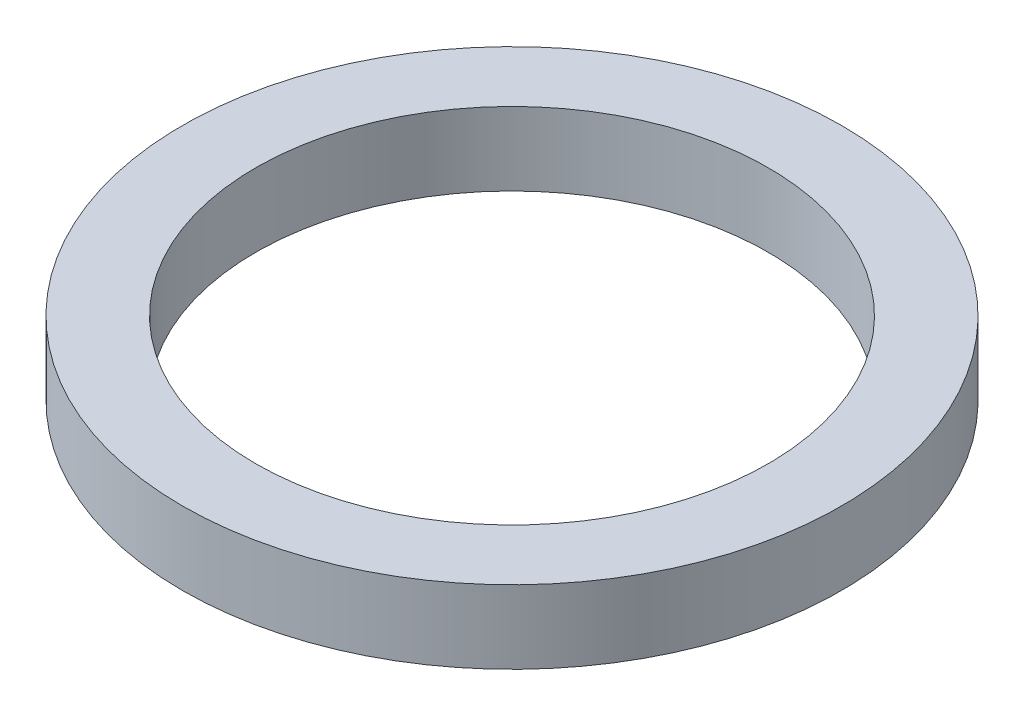
ISO-10303-21;
HEADER;
FILE_DESCRIPTION(('STEP AP214'),'2;1');
FILE_NAME('part.step','',(''),(''),'','','');
FILE_SCHEMA(('AUTOMOTIVE_DESIGN { 1 0 10303 214 1 1 1 1 }'));
ENDSEC;
DATA;
#1=APPLICATION_CONTEXT('core data for automotive mechanical design processes');
#2=APPLICATION_PROTOCOL_DEFINITION('international standard','automotive_design',2000,#1);
#3=PRODUCT_CONTEXT('',#1,'mechanical');
#4=PRODUCT('Part','Part','',(#3));
#5=PRODUCT_RELATED_PRODUCT_CATEGORY('part','',(#4));
#6=PRODUCT_DEFINITION_FORMATION('','',#4);
#7=PRODUCT_DEFINITION_CONTEXT('part definition',#1,'design');
#8=PRODUCT_DEFINITION('design','',#6,#7);
#9=PRODUCT_DEFINITION_SHAPE('','',#8);
#10=(LENGTH_UNIT() NAMED_UNIT(*) SI_UNIT(.MILLI.,.METRE.));
#11=(NAMED_UNIT(*) PLANE_ANGLE_UNIT() SI_UNIT($,.RADIAN.));
#12=(NAMED_UNIT(*) SI_UNIT($,.STERADIAN.) SOLID_ANGLE_UNIT());
#13=UNCERTAINTY_MEASURE_WITH_UNIT(LENGTH_MEASURE(1.E-05),#10,'distance_accuracy_value','');
#14=(GEOMETRIC_REPRESENTATION_CONTEXT(3) GLOBAL_UNCERTAINTY_ASSIGNED_CONTEXT((#13)) GLOBAL_UNIT_ASSIGNED_CONTEXT((#10,
#11,#12)) REPRESENTATION_CONTEXT('',''));
#15=CARTESIAN_POINT('',(0.,0.,0.));
#16=DIRECTION('',(0.,0.,1.));
#17=DIRECTION('',(1.,0.,0.));
#18=AXIS2_PLACEMENT_3D('',#15,#16,#17);
#19=CARTESIAN_POINT('',(0.,10.,0.));
#20=DIRECTION('',(0.,1.,0.));
#21=DIRECTION('',(0.,0.,1.));
#22=AXIS2_PLACEMENT_3D('',#19,#20,#21);
#23=PLANE('',#22);
#24=CARTESIAN_POINT('',(0.,10.,0.));
#25=DIRECTION('',(0.,1.,0.));
#26=DIRECTION('',(0.,0.,1.));
#27=AXIS2_PLACEMENT_3D('',#24,#25,#26);
#28=CIRCLE('',#27,45.);
#29=CARTESIAN_POINT('',(0.,10.,45.));
#30=VERTEX_POINT('',#29);
#31=EDGE_CURVE('E10',#30,#30,#28,.T.);
#32=ORIENTED_EDGE('',*,*,#31,.T.);
#33=EDGE_LOOP('',(#32));
#34=FACE_BOUND('',#33,.T.);
#35=CARTESIAN_POINT('',(0.,10.,0.));
#36=DIRECTION('',(0.,1.,0.));
#37=DIRECTION('',(0.,0.,1.));
#38=AXIS2_PLACEMENT_3D('',#35,#36,#37);
#39=CIRCLE('',#38,35.);
#40=CARTESIAN_POINT('',(0.,10.,35.));
#41=VERTEX_POINT('',#40);
#42=EDGE_CURVE('E50',#41,#41,#39,.T.);
#43=ORIENTED_EDGE('',*,*,#42,.F.);
#44=EDGE_LOOP('',(#43));
#45=FACE_BOUND('',#44,.T.);
#46=ADVANCED_FACE('F37',(#34,#45),#23,.T.);
#47=CARTESIAN_POINT('',(0.,0.,0.));
#48=DIRECTION('',(0.,1.,0.));
#49=DIRECTION('',(0.,0.,1.));
#50=AXIS2_PLACEMENT_3D('',#47,#48,#49);
#51=PLANE('',#50);
#52=CARTESIAN_POINT('',(0.,0.,0.));
#53=DIRECTION('',(0.,1.,0.));
#54=DIRECTION('',(0.,0.,1.));
#55=AXIS2_PLACEMENT_3D('',#52,#53,#54);
#56=CIRCLE('',#55,45.);
#57=CARTESIAN_POINT('',(0.,0.,45.));
#58=VERTEX_POINT('',#57);
#59=EDGE_CURVE('E41',#58,#58,#56,.T.);
#60=ORIENTED_EDGE('',*,*,#59,.F.);
#61=EDGE_LOOP('',(#60));
#62=FACE_BOUND('',#61,.T.);
#63=CARTESIAN_POINT('',(0.,0.,0.));
#64=DIRECTION('',(0.,1.,0.));
#65=DIRECTION('',(0.,0.,1.));
#66=AXIS2_PLACEMENT_3D('',#63,#64,#65);
#67=CIRCLE('',#66,35.);
#68=CARTESIAN_POINT('',(0.,0.,35.));
#69=VERTEX_POINT('',#68);
#70=EDGE_CURVE('E52',#69,#69,#67,.T.);
#71=ORIENTED_EDGE('',*,*,#70,.T.);
#72=EDGE_LOOP('',(#71));
#73=FACE_BOUND('',#72,.T.);
#74=ADVANCED_FACE('F64',(#62,#73),#51,.F.);
#75=CARTESIAN_POINT('',(0.,10.,0.));
#76=DIRECTION('',(0.,-1.,0.));
#77=DIRECTION('',(0.,0.,-1.));
#78=AXIS2_PLACEMENT_3D('',#75,#76,#77);
#79=CYLINDRICAL_SURFACE('',#78,45.);
#80=ORIENTED_EDGE('',*,*,#31,.F.);
#81=EDGE_LOOP('',(#80));
#82=FACE_BOUND('',#81,.T.);
#83=ORIENTED_EDGE('',*,*,#59,.T.);
#84=EDGE_LOOP('',(#83));
#85=FACE_BOUND('',#84,.T.);
#86=ADVANCED_FACE('F39',(#82,#85),#79,.T.);
#87=CARTESIAN_POINT('',(0.,10.,0.));
#88=DIRECTION('',(0.,-1.,0.));
#89=DIRECTION('',(0.,0.,-1.));
#90=AXIS2_PLACEMENT_3D('',#87,#88,#89);
#91=CYLINDRICAL_SURFACE('',#90,35.);
#92=ORIENTED_EDGE('',*,*,#42,.T.);
#93=EDGE_LOOP('',(#92));
#94=FACE_BOUND('',#93,.T.);
#95=ORIENTED_EDGE('',*,*,#70,.F.);
#96=EDGE_LOOP('',(#95));
#97=FACE_BOUND('',#96,.T.);
#98=ADVANCED_FACE('F60',(#94,#97),#91,.F.);
#99=CLOSED_SHELL('',(#46,#74,#86,#98));
#100=MANIFOLD_SOLID_BREP('B2',#99);
#101=ADVANCED_BREP_SHAPE_REPRESENTATION('',(#18,#100),#14);
#102=SHAPE_DEFINITION_REPRESENTATION(#9,#101);
ENDSEC;
END-ISO-10303-21;
